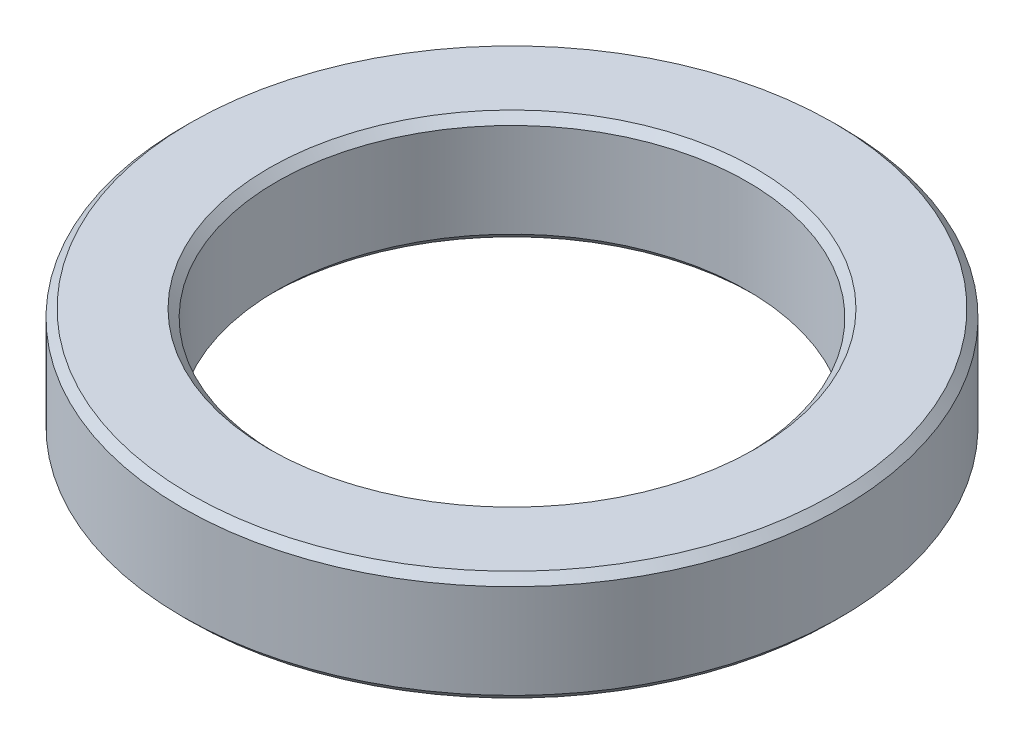
ISO-10303-21;
HEADER;
FILE_DESCRIPTION(('STEP AP214'),'2;1');
FILE_NAME('part.step','',(''),(''),'','','');
FILE_SCHEMA(('AUTOMOTIVE_DESIGN { 1 0 10303 214 1 1 1 1 }'));
ENDSEC;
DATA;
#1=APPLICATION_CONTEXT('core data for automotive mechanical design processes');
#2=APPLICATION_PROTOCOL_DEFINITION('international standard','automotive_design',2000,#1);
#3=PRODUCT_CONTEXT('',#1,'mechanical');
#4=PRODUCT('Part','Part','',(#3));
#5=PRODUCT_RELATED_PRODUCT_CATEGORY('part','',(#4));
#6=PRODUCT_DEFINITION_FORMATION('','',#4);
#7=PRODUCT_DEFINITION_CONTEXT('part definition',#1,'design');
#8=PRODUCT_DEFINITION('design','',#6,#7);
#9=PRODUCT_DEFINITION_SHAPE('','',#8);
#10=(LENGTH_UNIT() NAMED_UNIT(*) SI_UNIT(.MILLI.,.METRE.));
#11=(NAMED_UNIT(*) PLANE_ANGLE_UNIT() SI_UNIT($,.RADIAN.));
#12=(NAMED_UNIT(*) SI_UNIT($,.STERADIAN.) SOLID_ANGLE_UNIT());
#13=UNCERTAINTY_MEASURE_WITH_UNIT(LENGTH_MEASURE(1.E-05),#10,'distance_accuracy_value','');
#14=(GEOMETRIC_REPRESENTATION_CONTEXT(3) GLOBAL_UNCERTAINTY_ASSIGNED_CONTEXT((#13)) GLOBAL_UNIT_ASSIGNED_CONTEXT((#10,
#11,#12)) REPRESENTATION_CONTEXT('',''));
#15=CARTESIAN_POINT('',(0.,0.,0.));
#16=DIRECTION('',(0.,0.,1.));
#17=DIRECTION('',(1.,0.,0.));
#18=AXIS2_PLACEMENT_3D('',#15,#16,#17);
#19=CARTESIAN_POINT('',(0.,7.,0.));
#20=DIRECTION('',(0.,1.,0.));
#21=DIRECTION('',(0.,0.,1.));
#22=AXIS2_PLACEMENT_3D('',#19,#20,#21);
#23=PLANE('',#22);
#24=CARTESIAN_POINT('',(0.,7.,0.));
#25=DIRECTION('',(0.,1.,0.));
#26=DIRECTION('',(0.,0.,1.));
#27=AXIS2_PLACEMENT_3D('',#24,#25,#26);
#28=CIRCLE('',#27,15.5);
#29=CARTESIAN_POINT('',(0.,7.,15.5));
#30=VERTEX_POINT('',#29);
#31=EDGE_CURVE('E51',#30,#30,#28,.F.);
#32=ORIENTED_EDGE('',*,*,#31,.T.);
#33=EDGE_LOOP('',(#32));
#34=FACE_BOUND('',#33,.T.);
#35=CARTESIAN_POINT('',(0.,7.,0.));
#36=DIRECTION('',(0.,1.,0.));
#37=DIRECTION('',(0.,0.,1.));
#38=AXIS2_PLACEMENT_3D('',#35,#36,#37);
#39=CIRCLE('',#38,20.5);
#40=CARTESIAN_POINT('',(0.,7.,20.5));
#41=VERTEX_POINT('',#40);
#42=EDGE_CURVE('E55',#41,#41,#39,.T.);
#43=ORIENTED_EDGE('',*,*,#42,.T.);
#44=EDGE_LOOP('',(#43));
#45=FACE_BOUND('',#44,.T.);
#46=ADVANCED_FACE('F39',(#34,#45),#23,.T.);
#47=CARTESIAN_POINT('',(0.,0.,0.));
#48=DIRECTION('',(0.,1.,0.));
#49=DIRECTION('',(0.,0.,1.));
#50=AXIS2_PLACEMENT_3D('',#47,#48,#49);
#51=PLANE('',#50);
#52=CARTESIAN_POINT('',(0.,0.,0.));
#53=DIRECTION('',(0.,1.,0.));
#54=DIRECTION('',(0.,0.,1.));
#55=AXIS2_PLACEMENT_3D('',#52,#53,#54);
#56=CIRCLE('',#55,15.5);
#57=CARTESIAN_POINT('',(0.,0.,15.5));
#58=VERTEX_POINT('',#57);
#59=EDGE_CURVE('E66',#58,#58,#56,.T.);
#60=ORIENTED_EDGE('',*,*,#59,.T.);
#61=EDGE_LOOP('',(#60));
#62=FACE_BOUND('',#61,.T.);
#63=CARTESIAN_POINT('',(0.,0.,0.));
#64=DIRECTION('',(0.,1.,0.));
#65=DIRECTION('',(0.,0.,1.));
#66=AXIS2_PLACEMENT_3D('',#63,#64,#65);
#67=CIRCLE('',#66,20.5);
#68=CARTESIAN_POINT('',(0.,0.,20.5));
#69=VERTEX_POINT('',#68);
#70=EDGE_CURVE('E69',#69,#69,#67,.F.);
#71=ORIENTED_EDGE('',*,*,#70,.T.);
#72=EDGE_LOOP('',(#71));
#73=FACE_BOUND('',#72,.T.);
#74=ADVANCED_FACE('F73',(#62,#73),#51,.F.);
#75=CARTESIAN_POINT('',(0.,7.,0.));
#76=DIRECTION('',(0.,-1.,0.));
#77=DIRECTION('',(0.,0.,-1.));
#78=AXIS2_PLACEMENT_3D('',#75,#76,#77);
#79=CYLINDRICAL_SURFACE('',#78,21.);
#80=CARTESIAN_POINT('',(0.,0.5,0.));
#81=DIRECTION('',(0.,1.,0.));
#82=DIRECTION('',(0.,0.,1.));
#83=AXIS2_PLACEMENT_3D('',#80,#81,#82);
#84=CIRCLE('',#83,21.);
#85=CARTESIAN_POINT('',(0.,0.5,21.));
#86=VERTEX_POINT('',#85);
#87=EDGE_CURVE('E10',#86,#86,#84,.T.);
#88=ORIENTED_EDGE('',*,*,#87,.T.);
#89=EDGE_LOOP('',(#88));
#90=FACE_BOUND('',#89,.T.);
#91=CARTESIAN_POINT('',(0.,6.49999999999999,0.));
#92=DIRECTION('',(0.,1.,0.));
#93=DIRECTION('',(0.,0.,1.));
#94=AXIS2_PLACEMENT_3D('',#91,#92,#93);
#95=CIRCLE('',#94,21.);
#96=CARTESIAN_POINT('',(0.,6.49999999999999,21.));
#97=VERTEX_POINT('',#96);
#98=EDGE_CURVE('E47',#97,#97,#95,.F.);
#99=ORIENTED_EDGE('',*,*,#98,.T.);
#100=EDGE_LOOP('',(#99));
#101=FACE_BOUND('',#100,.T.);
#102=ADVANCED_FACE('F94',(#90,#101),#79,.T.);
#103=CARTESIAN_POINT('',(0.,7.,0.));
#104=DIRECTION('',(0.,-1.,0.));
#105=DIRECTION('',(0.,0.,-1.));
#106=AXIS2_PLACEMENT_3D('',#103,#104,#105);
#107=CYLINDRICAL_SURFACE('',#106,15.);
#108=CARTESIAN_POINT('',(0.,0.499999999999997,0.));
#109=DIRECTION('',(0.,1.,0.));
#110=DIRECTION('',(0.,0.,1.));
#111=AXIS2_PLACEMENT_3D('',#108,#109,#110);
#112=CIRCLE('',#111,15.);
#113=CARTESIAN_POINT('',(0.,0.499999999999997,15.));
#114=VERTEX_POINT('',#113);
#115=EDGE_CURVE('E60',#114,#114,#112,.F.);
#116=ORIENTED_EDGE('',*,*,#115,.T.);
#117=EDGE_LOOP('',(#116));
#118=FACE_BOUND('',#117,.T.);
#119=CARTESIAN_POINT('',(0.,6.49999999999999,0.));
#120=DIRECTION('',(0.,1.,0.));
#121=DIRECTION('',(0.,0.,1.));
#122=AXIS2_PLACEMENT_3D('',#119,#120,#121);
#123=CIRCLE('',#122,15.);
#124=CARTESIAN_POINT('',(0.,6.49999999999999,15.));
#125=VERTEX_POINT('',#124);
#126=EDGE_CURVE('E63',#125,#125,#123,.T.);
#127=ORIENTED_EDGE('',*,*,#126,.T.);
#128=EDGE_LOOP('',(#127));
#129=FACE_BOUND('',#128,.T.);
#130=ADVANCED_FACE('F99',(#118,#129),#107,.F.);
#131=CARTESIAN_POINT('',(0.,0.,0.));
#132=DIRECTION('',(0.,-1.,0.));
#133=DIRECTION('',(0.,0.,-1.));
#134=AXIS2_PLACEMENT_3D('',#131,#132,#133);
#135=CONICAL_SURFACE('',#134,15.5,0.785398163397447);
#136=ORIENTED_EDGE('',*,*,#115,.F.);
#137=EDGE_LOOP('',(#136));
#138=FACE_BOUND('',#137,.T.);
#139=ORIENTED_EDGE('',*,*,#59,.F.);
#140=EDGE_LOOP('',(#139));
#141=FACE_BOUND('',#140,.T.);
#142=ADVANCED_FACE('F84',(#138,#141),#135,.F.);
#143=CARTESIAN_POINT('',(0.,6.49999999999999,0.));
#144=DIRECTION('',(0.,1.,0.));
#145=DIRECTION('',(0.,0.,1.));
#146=AXIS2_PLACEMENT_3D('',#143,#144,#145);
#147=CONICAL_SURFACE('',#146,15.,0.785398163397452);
#148=ORIENTED_EDGE('',*,*,#31,.F.);
#149=EDGE_LOOP('',(#148));
#150=FACE_BOUND('',#149,.T.);
#151=ORIENTED_EDGE('',*,*,#126,.F.);
#152=EDGE_LOOP('',(#151));
#153=FACE_BOUND('',#152,.T.);
#154=ADVANCED_FACE('F78',(#150,#153),#147,.F.);
#155=CARTESIAN_POINT('',(0.,0.5,0.));
#156=DIRECTION('',(0.,1.,0.));
#157=DIRECTION('',(0.,0.,1.));
#158=AXIS2_PLACEMENT_3D('',#155,#156,#157);
#159=CONICAL_SURFACE('',#158,21.,0.785398163397448);
#160=ORIENTED_EDGE('',*,*,#70,.F.);
#161=EDGE_LOOP('',(#160));
#162=FACE_BOUND('',#161,.T.);
#163=ORIENTED_EDGE('',*,*,#87,.F.);
#164=EDGE_LOOP('',(#163));
#165=FACE_BOUND('',#164,.T.);
#166=ADVANCED_FACE('F75',(#162,#165),#159,.T.);
#167=CARTESIAN_POINT('',(0.,7.,0.));
#168=DIRECTION('',(0.,-1.,0.));
#169=DIRECTION('',(0.,0.,-1.));
#170=AXIS2_PLACEMENT_3D('',#167,#168,#169);
#171=CONICAL_SURFACE('',#170,20.5,0.785398163397441);
#172=ORIENTED_EDGE('',*,*,#98,.F.);
#173=EDGE_LOOP('',(#172));
#174=FACE_BOUND('',#173,.T.);
#175=ORIENTED_EDGE('',*,*,#42,.F.);
#176=EDGE_LOOP('',(#175));
#177=FACE_BOUND('',#176,.T.);
#178=ADVANCED_FACE('F42',(#174,#177),#171,.T.);
#179=CLOSED_SHELL('',(#46,#74,#102,#130,#142,#154,#166,#178));
#180=MANIFOLD_SOLID_BREP('B2',#179);
#181=ADVANCED_BREP_SHAPE_REPRESENTATION('',(#18,#180),#14);
#182=SHAPE_DEFINITION_REPRESENTATION(#9,#181);
ENDSEC;
END-ISO-10303-21;
